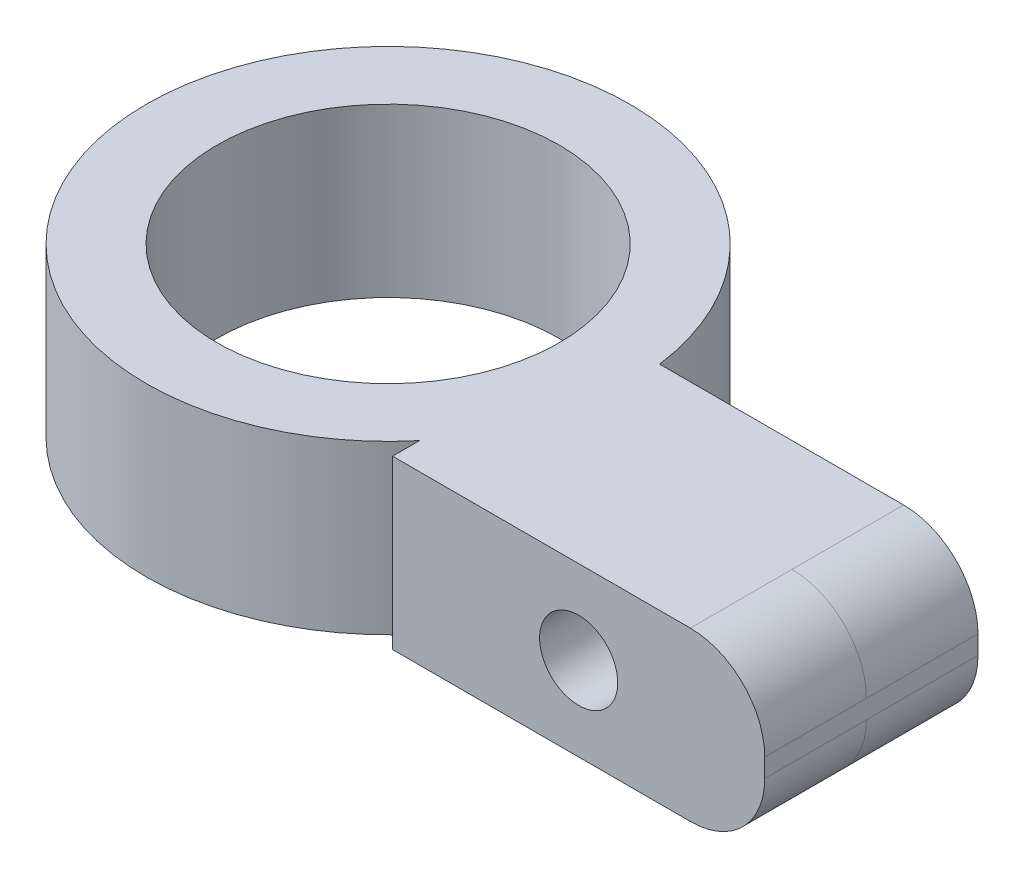
ISO-10303-21;
HEADER;
FILE_DESCRIPTION(('STEP AP214'),'2;1');
FILE_NAME('part.step','',(''),(''),'','','');
FILE_SCHEMA(('AUTOMOTIVE_DESIGN { 1 0 10303 214 1 1 1 1 }'));
ENDSEC;
DATA;
#1=APPLICATION_CONTEXT('core data for automotive mechanical design processes');
#2=APPLICATION_PROTOCOL_DEFINITION('international standard','automotive_design',2000,#1);
#3=PRODUCT_CONTEXT('',#1,'mechanical');
#4=PRODUCT('Part','Part','',(#3));
#5=PRODUCT_RELATED_PRODUCT_CATEGORY('part','',(#4));
#6=PRODUCT_DEFINITION_FORMATION('','',#4);
#7=PRODUCT_DEFINITION_CONTEXT('part definition',#1,'design');
#8=PRODUCT_DEFINITION('design','',#6,#7);
#9=PRODUCT_DEFINITION_SHAPE('','',#8);
#10=(LENGTH_UNIT() NAMED_UNIT(*) SI_UNIT(.MILLI.,.METRE.));
#11=(NAMED_UNIT(*) PLANE_ANGLE_UNIT() SI_UNIT($,.RADIAN.));
#12=(NAMED_UNIT(*) SI_UNIT($,.STERADIAN.) SOLID_ANGLE_UNIT());
#13=UNCERTAINTY_MEASURE_WITH_UNIT(LENGTH_MEASURE(1.E-05),#10,'distance_accuracy_value','');
#14=(GEOMETRIC_REPRESENTATION_CONTEXT(3) GLOBAL_UNCERTAINTY_ASSIGNED_CONTEXT((#13)) GLOBAL_UNIT_ASSIGNED_CONTEXT((#10,
#11,#12)) REPRESENTATION_CONTEXT('',''));
#15=CARTESIAN_POINT('',(0.,0.,0.));
#16=DIRECTION('',(0.,0.,1.));
#17=DIRECTION('',(1.,0.,0.));
#18=AXIS2_PLACEMENT_3D('',#15,#16,#17);
#19=CARTESIAN_POINT('',(-5.,-2.25,3.));
#20=DIRECTION('',(1.,0.,0.));
#21=DIRECTION('',(0.,0.,-1.));
#22=AXIS2_PLACEMENT_3D('',#19,#20,#21);
#23=PLANE('',#22);
#24=DIRECTION('',(0.,-1.,0.));
#25=VECTOR('',#24,1.);
#26=CARTESIAN_POINT('',(-5.,2.25,5.00331193145904));
#27=LINE('',#26,#25);
#28=CARTESIAN_POINT('',(-5.,-2.25,5.00331193145904));
#29=VERTEX_POINT('',#28);
#30=CARTESIAN_POINT('',(-5.,2.25,5.00331193145904));
#31=VERTEX_POINT('',#30);
#32=EDGE_CURVE('E113',#29,#31,#27,.F.);
#33=ORIENTED_EDGE('',*,*,#32,.F.);
#34=DIRECTION('',(0.,0.,-1.));
#35=VECTOR('',#34,1.);
#36=CARTESIAN_POINT('',(-5.,-2.25,3.));
#37=LINE('',#36,#35);
#38=CARTESIAN_POINT('',(-5.,-2.25,5.73));
#39=VERTEX_POINT('',#38);
#40=EDGE_CURVE('E126',#39,#29,#37,.T.);
#41=ORIENTED_EDGE('',*,*,#40,.F.);
#42=DIRECTION('',(0.,-1.,0.));
#43=VECTOR('',#42,1.);
#44=CARTESIAN_POINT('',(-5.,2.25,5.73));
#45=LINE('',#44,#43);
#46=CARTESIAN_POINT('',(-5.,2.25,5.73));
#47=VERTEX_POINT('',#46);
#48=EDGE_CURVE('E130',#47,#39,#45,.T.);
#49=ORIENTED_EDGE('',*,*,#48,.F.);
#50=DIRECTION('',(0.,0.,-1.));
#51=VECTOR('',#50,1.);
#52=CARTESIAN_POINT('',(-5.,2.25,3.));
#53=LINE('',#52,#51);
#54=EDGE_CURVE('E128',#47,#31,#53,.T.);
#55=ORIENTED_EDGE('',*,*,#54,.T.);
#56=EDGE_LOOP('',(#33,#41,#49,#55));
#57=FACE_BOUND('',#56,.T.);
#58=ADVANCED_FACE('F39',(#57),#23,.F.);
#59=CARTESIAN_POINT('',(0.,0.,0.));
#60=DIRECTION('',(0.,0.,1.));
#61=DIRECTION('',(1.,0.,0.));
#62=AXIS2_PLACEMENT_3D('',#59,#60,#61);
#63=PLANE('',#62);
#64=DIRECTION('',(0.,-1.,0.));
#65=VECTOR('',#64,1.);
#66=CARTESIAN_POINT('',(-3.55581657616731,2.25,0.));
#67=LINE('',#66,#65);
#68=CARTESIAN_POINT('',(-3.55581657616731,2.25,0.));
#69=VERTEX_POINT('',#68);
#70=CARTESIAN_POINT('',(-3.55581657616731,-2.25,0.));
#71=VERTEX_POINT('',#70);
#72=EDGE_CURVE('E116',#69,#71,#67,.T.);
#73=ORIENTED_EDGE('',*,*,#72,.F.);
#74=DIRECTION('',(-1.,0.,0.));
#75=VECTOR('',#74,1.);
#76=CARTESIAN_POINT('',(5.,2.25,0.));
#77=LINE('',#76,#75);
#78=CARTESIAN_POINT('',(3.,2.25,0.));
#79=VERTEX_POINT('',#78);
#80=EDGE_CURVE('E143',#79,#69,#77,.T.);
#81=ORIENTED_EDGE('',*,*,#80,.F.);
#82=CARTESIAN_POINT('',(3.,0.249999999999999,0.));
#83=DIRECTION('',(0.,0.,1.));
#84=DIRECTION('',(1.,0.,0.));
#85=AXIS2_PLACEMENT_3D('',#82,#83,#84);
#86=CIRCLE('',#85,2.);
#87=CARTESIAN_POINT('',(5.,0.249999999999999,0.));
#88=VERTEX_POINT('',#87);
#89=EDGE_CURVE('E150',#79,#88,#86,.F.);
#90=ORIENTED_EDGE('',*,*,#89,.T.);
#91=DIRECTION('',(0.,1.,0.));
#92=VECTOR('',#91,1.);
#93=CARTESIAN_POINT('',(5.,-2.25,0.));
#94=LINE('',#93,#92);
#95=CARTESIAN_POINT('',(5.,-0.25,0.));
#96=VERTEX_POINT('',#95);
#97=EDGE_CURVE('E212',#96,#88,#94,.T.);
#98=ORIENTED_EDGE('',*,*,#97,.F.);
#99=CARTESIAN_POINT('',(3.,-0.25,0.));
#100=DIRECTION('',(0.,0.,1.));
#101=DIRECTION('',(1.,0.,0.));
#102=AXIS2_PLACEMENT_3D('',#99,#100,#101);
#103=CIRCLE('',#102,2.);
#104=CARTESIAN_POINT('',(3.,-2.25,0.));
#105=VERTEX_POINT('',#104);
#106=EDGE_CURVE('E153',#96,#105,#103,.F.);
#107=ORIENTED_EDGE('',*,*,#106,.T.);
#108=DIRECTION('',(1.,0.,0.));
#109=VECTOR('',#108,1.);
#110=CARTESIAN_POINT('',(5.,-2.25,0.));
#111=LINE('',#110,#109);
#112=EDGE_CURVE('E198',#71,#105,#111,.T.);
#113=ORIENTED_EDGE('',*,*,#112,.F.);
#114=EDGE_LOOP('',(#73,#81,#90,#98,#107,#113));
#115=FACE_BOUND('',#114,.T.);
#116=ADVANCED_FACE('F208',(#115),#63,.F.);
#117=CARTESIAN_POINT('',(5.,-2.25,3.));
#118=DIRECTION('',(0.,1.,0.));
#119=DIRECTION('',(-1.,0.,0.));
#120=AXIS2_PLACEMENT_3D('',#117,#118,#119);
#121=PLANE('',#120);
#122=DIRECTION('',(0.,0.,-1.));
#123=VECTOR('',#122,1.);
#124=CARTESIAN_POINT('',(3.,-2.25,3.));
#125=LINE('',#124,#123);
#126=CARTESIAN_POINT('',(3.,-2.25,3.));
#127=VERTEX_POINT('',#126);
#128=EDGE_CURVE('E157',#105,#127,#125,.F.);
#129=ORIENTED_EDGE('',*,*,#128,.T.);
#130=DIRECTION('',(0.,0.,-1.));
#131=VECTOR('',#130,1.);
#132=CARTESIAN_POINT('',(3.,-2.25,3.));
#133=LINE('',#132,#131);
#134=CARTESIAN_POINT('',(3.,-2.25,5.73));
#135=VERTEX_POINT('',#134);
#136=EDGE_CURVE('E11',#127,#135,#133,.F.);
#137=ORIENTED_EDGE('',*,*,#136,.T.);
#138=DIRECTION('',(1.,0.,0.));
#139=VECTOR('',#138,1.);
#140=CARTESIAN_POINT('',(-5.,-2.25,5.73));
#141=LINE('',#140,#139);
#142=EDGE_CURVE('E134',#39,#135,#141,.T.);
#143=ORIENTED_EDGE('',*,*,#142,.F.);
#144=ORIENTED_EDGE('',*,*,#40,.T.);
#145=CARTESIAN_POINT('',(-10.,-2.25,0.85));
#146=DIRECTION('',(0.,1.,0.));
#147=DIRECTION('',(0.,0.,1.));
#148=AXIS2_PLACEMENT_3D('',#145,#146,#147);
#149=CIRCLE('',#148,6.5);
#150=EDGE_CURVE('E110',#71,#29,#149,.T.);
#151=ORIENTED_EDGE('',*,*,#150,.F.);
#152=ORIENTED_EDGE('',*,*,#112,.T.);
#153=EDGE_LOOP('',(#129,#137,#143,#144,#151,#152));
#154=FACE_BOUND('',#153,.T.);
#155=CARTESIAN_POINT('',(-10.,-2.25,0.85));
#156=DIRECTION('',(0.,-1.,0.));
#157=DIRECTION('',(0.,0.,-1.));
#158=AXIS2_PLACEMENT_3D('',#155,#156,#157);
#159=CIRCLE('',#158,4.6);
#160=CARTESIAN_POINT('',(-10.,-2.25,-3.75));
#161=VERTEX_POINT('',#160);
#162=EDGE_CURVE('E226',#161,#161,#159,.T.);
#163=ORIENTED_EDGE('',*,*,#162,.F.);
#164=EDGE_LOOP('',(#163));
#165=FACE_BOUND('',#164,.T.);
#166=ADVANCED_FACE('F132',(#154,#165),#121,.F.);
#167=CARTESIAN_POINT('',(5.,-2.25,3.));
#168=DIRECTION('',(-1.,0.,0.));
#169=DIRECTION('',(0.,0.,1.));
#170=AXIS2_PLACEMENT_3D('',#167,#168,#169);
#171=PLANE('',#170);
#172=DIRECTION('',(0.,0.,-1.));
#173=VECTOR('',#172,1.);
#174=CARTESIAN_POINT('',(5.,0.249999999999999,3.));
#175=LINE('',#174,#173);
#176=CARTESIAN_POINT('',(5.,0.249999999999999,3.));
#177=VERTEX_POINT('',#176);
#178=EDGE_CURVE('E137',#88,#177,#175,.F.);
#179=ORIENTED_EDGE('',*,*,#178,.T.);
#180=DIRECTION('',(0.,0.,-1.));
#181=VECTOR('',#180,1.);
#182=CARTESIAN_POINT('',(5.,0.249999999999999,3.));
#183=LINE('',#182,#181);
#184=CARTESIAN_POINT('',(5.,0.249999999999999,5.73));
#185=VERTEX_POINT('',#184);
#186=EDGE_CURVE('E61',#177,#185,#183,.F.);
#187=ORIENTED_EDGE('',*,*,#186,.T.);
#188=DIRECTION('',(0.,1.,0.));
#189=VECTOR('',#188,1.);
#190=CARTESIAN_POINT('',(5.,-2.25,5.73));
#191=LINE('',#190,#189);
#192=CARTESIAN_POINT('',(5.,-0.25,5.73));
#193=VERTEX_POINT('',#192);
#194=EDGE_CURVE('E190',#193,#185,#191,.T.);
#195=ORIENTED_EDGE('',*,*,#194,.F.);
#196=DIRECTION('',(0.,0.,-1.));
#197=VECTOR('',#196,1.);
#198=CARTESIAN_POINT('',(5.,-0.25,3.));
#199=LINE('',#198,#197);
#200=CARTESIAN_POINT('',(5.,-0.25,3.));
#201=VERTEX_POINT('',#200);
#202=EDGE_CURVE('E176',#193,#201,#199,.T.);
#203=ORIENTED_EDGE('',*,*,#202,.T.);
#204=DIRECTION('',(0.,0.,-1.));
#205=VECTOR('',#204,1.);
#206=CARTESIAN_POINT('',(5.,-0.25,3.));
#207=LINE('',#206,#205);
#208=EDGE_CURVE('E141',#201,#96,#207,.T.);
#209=ORIENTED_EDGE('',*,*,#208,.T.);
#210=ORIENTED_EDGE('',*,*,#97,.T.);
#211=EDGE_LOOP('',(#179,#187,#195,#203,#209,#210));
#212=FACE_BOUND('',#211,.T.);
#213=ADVANCED_FACE('F289',(#212),#171,.F.);
#214=CARTESIAN_POINT('',(5.,2.25,3.));
#215=DIRECTION('',(0.,-1.,0.));
#216=DIRECTION('',(1.,0.,0.));
#217=AXIS2_PLACEMENT_3D('',#214,#215,#216);
#218=PLANE('',#217);
#219=DIRECTION('',(-1.,0.,0.));
#220=VECTOR('',#219,1.);
#221=CARTESIAN_POINT('',(5.,2.25,5.73));
#222=LINE('',#221,#220);
#223=CARTESIAN_POINT('',(3.,2.25,5.73));
#224=VERTEX_POINT('',#223);
#225=EDGE_CURVE('E189',#224,#47,#222,.T.);
#226=ORIENTED_EDGE('',*,*,#225,.F.);
#227=DIRECTION('',(0.,0.,-1.));
#228=VECTOR('',#227,1.);
#229=CARTESIAN_POINT('',(3.,2.25,3.));
#230=LINE('',#229,#228);
#231=CARTESIAN_POINT('',(3.,2.25,3.));
#232=VERTEX_POINT('',#231);
#233=EDGE_CURVE('E172',#224,#232,#230,.T.);
#234=ORIENTED_EDGE('',*,*,#233,.T.);
#235=DIRECTION('',(0.,0.,-1.));
#236=VECTOR('',#235,1.);
#237=CARTESIAN_POINT('',(3.,2.25,3.));
#238=LINE('',#237,#236);
#239=EDGE_CURVE('E166',#232,#79,#238,.T.);
#240=ORIENTED_EDGE('',*,*,#239,.T.);
#241=ORIENTED_EDGE('',*,*,#80,.T.);
#242=CARTESIAN_POINT('',(-10.,2.25,0.85));
#243=DIRECTION('',(0.,1.,0.));
#244=DIRECTION('',(0.,0.,1.));
#245=AXIS2_PLACEMENT_3D('',#242,#243,#244);
#246=CIRCLE('',#245,6.5);
#247=EDGE_CURVE('E120',#69,#31,#246,.T.);
#248=ORIENTED_EDGE('',*,*,#247,.T.);
#249=ORIENTED_EDGE('',*,*,#54,.F.);
#250=EDGE_LOOP('',(#226,#234,#240,#241,#248,#249));
#251=FACE_BOUND('',#250,.T.);
#252=CARTESIAN_POINT('',(-10.,2.25,0.85));
#253=DIRECTION('',(0.,-1.,0.));
#254=DIRECTION('',(0.,0.,-1.));
#255=AXIS2_PLACEMENT_3D('',#252,#253,#254);
#256=CIRCLE('',#255,4.6);
#257=CARTESIAN_POINT('',(-10.,2.25,-3.75));
#258=VERTEX_POINT('',#257);
#259=EDGE_CURVE('E121',#258,#258,#256,.T.);
#260=ORIENTED_EDGE('',*,*,#259,.T.);
#261=EDGE_LOOP('',(#260));
#262=FACE_BOUND('',#261,.T.);
#263=ADVANCED_FACE('F194',(#251,#262),#218,.F.);
#264=CARTESIAN_POINT('',(3.,-0.25,3.));
#265=DIRECTION('',(0.,0.,-1.));
#266=DIRECTION('',(-1.,0.,0.));
#267=AXIS2_PLACEMENT_3D('',#264,#265,#266);
#268=CYLINDRICAL_SURFACE('',#267,2.);
#269=CARTESIAN_POINT('',(3.,-0.25,3.));
#270=DIRECTION('',(0.,0.,1.));
#271=DIRECTION('',(1.,0.,0.));
#272=AXIS2_PLACEMENT_3D('',#269,#270,#271);
#273=CIRCLE('',#272,2.);
#274=EDGE_CURVE('E163',#127,#201,#273,.T.);
#275=ORIENTED_EDGE('',*,*,#274,.F.);
#276=ORIENTED_EDGE('',*,*,#128,.F.);
#277=ORIENTED_EDGE('',*,*,#106,.F.);
#278=ORIENTED_EDGE('',*,*,#208,.F.);
#279=EDGE_LOOP('',(#275,#276,#277,#278));
#280=FACE_BOUND('',#279,.T.);
#281=ADVANCED_FACE('F258',(#280),#268,.T.);
#282=CARTESIAN_POINT('',(3.,0.249999999999999,3.));
#283=DIRECTION('',(0.,0.,-1.));
#284=DIRECTION('',(-1.,0.,0.));
#285=AXIS2_PLACEMENT_3D('',#282,#283,#284);
#286=CYLINDRICAL_SURFACE('',#285,2.);
#287=CARTESIAN_POINT('',(3.,0.249999999999999,3.));
#288=DIRECTION('',(0.,0.,1.));
#289=DIRECTION('',(1.,0.,0.));
#290=AXIS2_PLACEMENT_3D('',#287,#288,#289);
#291=CIRCLE('',#290,2.);
#292=EDGE_CURVE('E160',#177,#232,#291,.T.);
#293=ORIENTED_EDGE('',*,*,#292,.F.);
#294=ORIENTED_EDGE('',*,*,#178,.F.);
#295=ORIENTED_EDGE('',*,*,#89,.F.);
#296=ORIENTED_EDGE('',*,*,#239,.F.);
#297=EDGE_LOOP('',(#293,#294,#295,#296));
#298=FACE_BOUND('',#297,.T.);
#299=ADVANCED_FACE('F204',(#298),#286,.T.);
#300=CARTESIAN_POINT('',(0.,0.,5.73));
#301=DIRECTION('',(0.,0.,1.));
#302=DIRECTION('',(1.,0.,0.));
#303=AXIS2_PLACEMENT_3D('',#300,#301,#302);
#304=PLANE('',#303);
#305=CARTESIAN_POINT('',(0.,0.,5.73));
#306=DIRECTION('',(0.,0.,1.));
#307=DIRECTION('',(1.,0.,0.));
#308=AXIS2_PLACEMENT_3D('',#305,#306,#307);
#309=CIRCLE('',#308,1.05);
#310=CARTESIAN_POINT('',(1.05,0.,5.73));
#311=VERTEX_POINT('',#310);
#312=EDGE_CURVE('E234',#311,#311,#309,.T.);
#313=ORIENTED_EDGE('',*,*,#312,.F.);
#314=EDGE_LOOP('',(#313));
#315=FACE_BOUND('',#314,.T.);
#316=ORIENTED_EDGE('',*,*,#194,.T.);
#317=CARTESIAN_POINT('',(3.,0.249999999999999,5.73));
#318=DIRECTION('',(0.,0.,1.));
#319=DIRECTION('',(1.,0.,0.));
#320=AXIS2_PLACEMENT_3D('',#317,#318,#319);
#321=CIRCLE('',#320,2.);
#322=EDGE_CURVE('E48',#185,#224,#321,.T.);
#323=ORIENTED_EDGE('',*,*,#322,.T.);
#324=ORIENTED_EDGE('',*,*,#225,.T.);
#325=ORIENTED_EDGE('',*,*,#48,.T.);
#326=ORIENTED_EDGE('',*,*,#142,.T.);
#327=CARTESIAN_POINT('',(3.,-0.25,5.73));
#328=DIRECTION('',(0.,0.,1.));
#329=DIRECTION('',(1.,0.,0.));
#330=AXIS2_PLACEMENT_3D('',#327,#328,#329);
#331=CIRCLE('',#330,2.);
#332=EDGE_CURVE('E182',#135,#193,#331,.T.);
#333=ORIENTED_EDGE('',*,*,#332,.T.);
#334=EDGE_LOOP('',(#316,#323,#324,#325,#326,#333));
#335=FACE_BOUND('',#334,.T.);
#336=ADVANCED_FACE('F188',(#315,#335),#304,.T.);
#337=CARTESIAN_POINT('',(-10.,2.25,0.85));
#338=DIRECTION('',(0.,-1.,0.));
#339=DIRECTION('',(0.,0.,-1.));
#340=AXIS2_PLACEMENT_3D('',#337,#338,#339);
#341=CYLINDRICAL_SURFACE('',#340,6.5);
#342=ORIENTED_EDGE('',*,*,#150,.T.);
#343=ORIENTED_EDGE('',*,*,#32,.T.);
#344=ORIENTED_EDGE('',*,*,#247,.F.);
#345=ORIENTED_EDGE('',*,*,#72,.T.);
#346=EDGE_LOOP('',(#342,#343,#344,#345));
#347=FACE_BOUND('',#346,.T.);
#348=ADVANCED_FACE('F112',(#347),#341,.T.);
#349=CARTESIAN_POINT('',(-10.,2.25,0.85));
#350=DIRECTION('',(0.,-1.,0.));
#351=DIRECTION('',(0.,0.,-1.));
#352=AXIS2_PLACEMENT_3D('',#349,#350,#351);
#353=CYLINDRICAL_SURFACE('',#352,4.6);
#354=ORIENTED_EDGE('',*,*,#259,.F.);
#355=EDGE_LOOP('',(#354));
#356=FACE_BOUND('',#355,.T.);
#357=ORIENTED_EDGE('',*,*,#162,.T.);
#358=EDGE_LOOP('',(#357));
#359=FACE_BOUND('',#358,.T.);
#360=ADVANCED_FACE('F247',(#356,#359),#353,.F.);
#361=CARTESIAN_POINT('',(0.,0.,2.73));
#362=DIRECTION('',(0.,0.,1.));
#363=DIRECTION('',(1.,0.,0.));
#364=AXIS2_PLACEMENT_3D('',#361,#362,#363);
#365=CYLINDRICAL_SURFACE('',#364,1.05);
#366=CARTESIAN_POINT('',(0.,0.,2.73));
#367=DIRECTION('',(0.,0.,1.));
#368=DIRECTION('',(1.,0.,0.));
#369=AXIS2_PLACEMENT_3D('',#366,#367,#368);
#370=CIRCLE('',#369,1.05);
#371=CARTESIAN_POINT('',(1.05,0.,2.73));
#372=VERTEX_POINT('',#371);
#373=EDGE_CURVE('E230',#372,#372,#370,.T.);
#374=ORIENTED_EDGE('',*,*,#373,.F.);
#375=EDGE_LOOP('',(#374));
#376=FACE_BOUND('',#375,.T.);
#377=ORIENTED_EDGE('',*,*,#312,.T.);
#378=EDGE_LOOP('',(#377));
#379=FACE_BOUND('',#378,.T.);
#380=ADVANCED_FACE('F244',(#376,#379),#365,.F.);
#381=CARTESIAN_POINT('',(0.,0.,2.73));
#382=DIRECTION('',(0.,0.,1.));
#383=DIRECTION('',(1.,0.,0.));
#384=AXIS2_PLACEMENT_3D('',#381,#382,#383);
#385=PLANE('',#384);
#386=ORIENTED_EDGE('',*,*,#373,.T.);
#387=EDGE_LOOP('',(#386));
#388=FACE_BOUND('',#387,.T.);
#389=ADVANCED_FACE('F242',(#388),#385,.T.);
#390=CARTESIAN_POINT('',(3.,0.249999999999999,3.));
#391=DIRECTION('',(0.,0.,-1.));
#392=DIRECTION('',(-1.,0.,0.));
#393=AXIS2_PLACEMENT_3D('',#390,#391,#392);
#394=CYLINDRICAL_SURFACE('',#393,2.);
#395=ORIENTED_EDGE('',*,*,#322,.F.);
#396=ORIENTED_EDGE('',*,*,#186,.F.);
#397=ORIENTED_EDGE('',*,*,#292,.T.);
#398=ORIENTED_EDGE('',*,*,#233,.F.);
#399=EDGE_LOOP('',(#395,#396,#397,#398));
#400=FACE_BOUND('',#399,.T.);
#401=ADVANCED_FACE('F200',(#400),#394,.T.);
#402=CARTESIAN_POINT('',(3.,-0.25,3.));
#403=DIRECTION('',(0.,0.,-1.));
#404=DIRECTION('',(-1.,0.,0.));
#405=AXIS2_PLACEMENT_3D('',#402,#403,#404);
#406=CYLINDRICAL_SURFACE('',#405,2.);
#407=ORIENTED_EDGE('',*,*,#332,.F.);
#408=ORIENTED_EDGE('',*,*,#136,.F.);
#409=ORIENTED_EDGE('',*,*,#274,.T.);
#410=ORIENTED_EDGE('',*,*,#202,.F.);
#411=EDGE_LOOP('',(#407,#408,#409,#410));
#412=FACE_BOUND('',#411,.T.);
#413=ADVANCED_FACE('F41',(#412),#406,.T.);
#414=CLOSED_SHELL('',(#58,#116,#166,#213,#263,#281,#299,#336,#348,#360,#380,#389,#401,#413));
#415=MANIFOLD_SOLID_BREP('B2',#414);
#416=ADVANCED_BREP_SHAPE_REPRESENTATION('',(#18,#415),#14);
#417=SHAPE_DEFINITION_REPRESENTATION(#9,#416);
ENDSEC;
END-ISO-10303-21;
